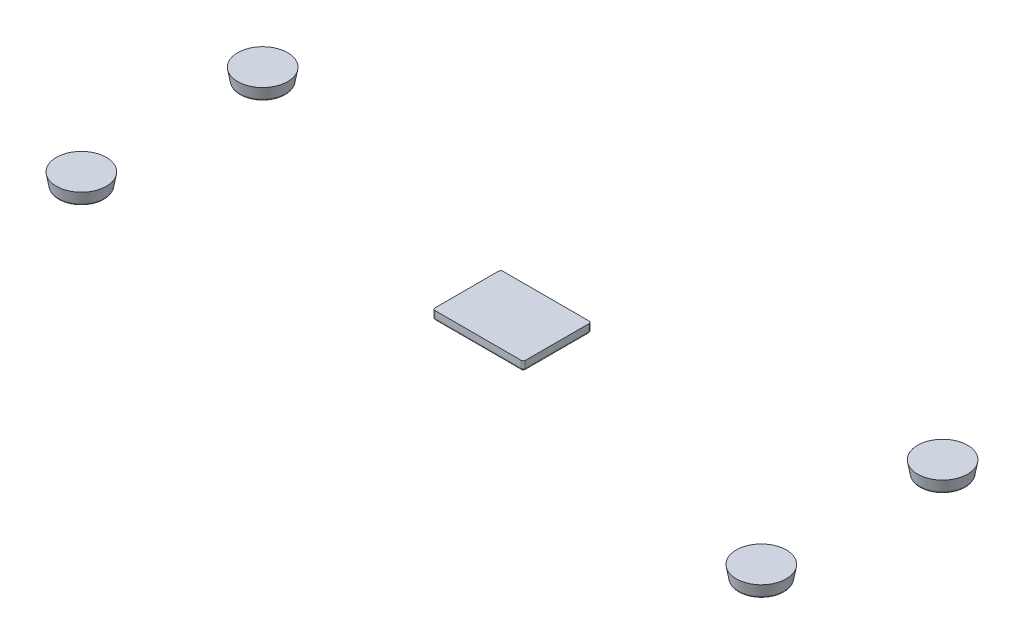
ISO-10303-21;
HEADER;
FILE_DESCRIPTION(('STEP AP214'),'2;1');
FILE_NAME('part.step','',(''),(''),'','','');
FILE_SCHEMA(('AUTOMOTIVE_DESIGN { 1 0 10303 214 1 1 1 1 }'));
ENDSEC;
DATA;
#1=APPLICATION_CONTEXT('core data for automotive mechanical design processes');
#2=APPLICATION_PROTOCOL_DEFINITION('international standard','automotive_design',2000,#1);
#3=PRODUCT_CONTEXT('',#1,'mechanical');
#4=PRODUCT('Part','Part','',(#3));
#5=PRODUCT_RELATED_PRODUCT_CATEGORY('part','',(#4));
#6=PRODUCT_DEFINITION_FORMATION('','',#4);
#7=PRODUCT_DEFINITION_CONTEXT('part definition',#1,'design');
#8=PRODUCT_DEFINITION('design','',#6,#7);
#9=PRODUCT_DEFINITION_SHAPE('','',#8);
#10=(LENGTH_UNIT() NAMED_UNIT(*) SI_UNIT(.MILLI.,.METRE.));
#11=(NAMED_UNIT(*) PLANE_ANGLE_UNIT() SI_UNIT($,.RADIAN.));
#12=(NAMED_UNIT(*) SI_UNIT($,.STERADIAN.) SOLID_ANGLE_UNIT());
#13=UNCERTAINTY_MEASURE_WITH_UNIT(LENGTH_MEASURE(1.E-05),#10,'distance_accuracy_value','');
#14=(GEOMETRIC_REPRESENTATION_CONTEXT(3) GLOBAL_UNCERTAINTY_ASSIGNED_CONTEXT((#13)) GLOBAL_UNIT_ASSIGNED_CONTEXT((#10,
#11,#12)) REPRESENTATION_CONTEXT('',''));
#15=CARTESIAN_POINT('',(0.,0.,0.));
#16=DIRECTION('',(0.,0.,1.));
#17=DIRECTION('',(1.,0.,0.));
#18=AXIS2_PLACEMENT_3D('',#15,#16,#17);
#19=CARTESIAN_POINT('',(10.,0.95,-7.5));
#20=DIRECTION('',(1.,0.,0.));
#21=DIRECTION('',(0.,0.,-1.));
#22=AXIS2_PLACEMENT_3D('',#19,#20,#21);
#23=PLANE('',#22);
#24=DIRECTION('',(0.,1.,0.));
#25=VECTOR('',#24,1.);
#26=CARTESIAN_POINT('',(10.,0.95,7.));
#27=LINE('',#26,#25);
#28=CARTESIAN_POINT('',(10.,2.95,7.));
#29=VERTEX_POINT('',#28);
#30=CARTESIAN_POINT('',(10.,1.45,7.));
#31=VERTEX_POINT('',#30);
#32=EDGE_CURVE('E172',#29,#31,#27,.F.);
#33=ORIENTED_EDGE('',*,*,#32,.T.);
#34=DIRECTION('',(0.,0.,-1.));
#35=VECTOR('',#34,1.);
#36=CARTESIAN_POINT('',(10.,1.45,-7.));
#37=LINE('',#36,#35);
#38=CARTESIAN_POINT('',(10.,1.45,-7.));
#39=VERTEX_POINT('',#38);
#40=EDGE_CURVE('E193',#31,#39,#37,.T.);
#41=ORIENTED_EDGE('',*,*,#40,.T.);
#42=DIRECTION('',(0.,1.,0.));
#43=VECTOR('',#42,1.);
#44=CARTESIAN_POINT('',(10.,0.95,-7.));
#45=LINE('',#44,#43);
#46=CARTESIAN_POINT('',(10.,2.95,-7.));
#47=VERTEX_POINT('',#46);
#48=EDGE_CURVE('E170',#39,#47,#45,.T.);
#49=ORIENTED_EDGE('',*,*,#48,.T.);
#50=DIRECTION('',(0.,0.,-1.));
#51=VECTOR('',#50,1.);
#52=CARTESIAN_POINT('',(10.,2.95,-7.5));
#53=LINE('',#52,#51);
#54=EDGE_CURVE('E130',#29,#47,#53,.T.);
#55=ORIENTED_EDGE('',*,*,#54,.F.);
#56=EDGE_LOOP('',(#33,#41,#49,#55));
#57=FACE_BOUND('',#56,.T.);
#58=ADVANCED_FACE('F46',(#57),#23,.T.);
#59=CARTESIAN_POINT('',(-9.99999999999999,0.95,7.5));
#60=DIRECTION('',(0.,0.,1.));
#61=DIRECTION('',(1.,0.,0.));
#62=AXIS2_PLACEMENT_3D('',#59,#60,#61);
#63=PLANE('',#62);
#64=DIRECTION('',(0.,1.,0.));
#65=VECTOR('',#64,1.);
#66=CARTESIAN_POINT('',(-9.49999999999999,0.95,7.5));
#67=LINE('',#66,#65);
#68=CARTESIAN_POINT('',(-9.49999999999999,2.95,7.5));
#69=VERTEX_POINT('',#68);
#70=CARTESIAN_POINT('',(-9.49999999999999,1.45,7.5));
#71=VERTEX_POINT('',#70);
#72=EDGE_CURVE('E168',#69,#71,#67,.F.);
#73=ORIENTED_EDGE('',*,*,#72,.T.);
#74=DIRECTION('',(1.,0.,0.));
#75=VECTOR('',#74,1.);
#76=CARTESIAN_POINT('',(9.5,1.45,7.5));
#77=LINE('',#76,#75);
#78=CARTESIAN_POINT('',(9.5,1.45,7.5));
#79=VERTEX_POINT('',#78);
#80=EDGE_CURVE('E12',#71,#79,#77,.T.);
#81=ORIENTED_EDGE('',*,*,#80,.T.);
#82=DIRECTION('',(0.,1.,0.));
#83=VECTOR('',#82,1.);
#84=CARTESIAN_POINT('',(9.5,0.95,7.5));
#85=LINE('',#84,#83);
#86=CARTESIAN_POINT('',(9.5,2.95,7.5));
#87=VERTEX_POINT('',#86);
#88=EDGE_CURVE('E166',#79,#87,#85,.T.);
#89=ORIENTED_EDGE('',*,*,#88,.T.);
#90=DIRECTION('',(1.,0.,0.));
#91=VECTOR('',#90,1.);
#92=CARTESIAN_POINT('',(-9.99999999999999,2.95,7.5));
#93=LINE('',#92,#91);
#94=EDGE_CURVE('E149',#69,#87,#93,.T.);
#95=ORIENTED_EDGE('',*,*,#94,.F.);
#96=EDGE_LOOP('',(#73,#81,#89,#95));
#97=FACE_BOUND('',#96,.T.);
#98=ADVANCED_FACE('F271',(#97),#63,.T.);
#99=CARTESIAN_POINT('',(-10.,0.95,-7.5));
#100=DIRECTION('',(-1.,0.,0.));
#101=DIRECTION('',(0.,0.,1.));
#102=AXIS2_PLACEMENT_3D('',#99,#100,#101);
#103=PLANE('',#102);
#104=DIRECTION('',(0.,1.,0.));
#105=VECTOR('',#104,1.);
#106=CARTESIAN_POINT('',(-10.,0.95,-7.));
#107=LINE('',#106,#105);
#108=CARTESIAN_POINT('',(-10.,2.95,-7.));
#109=VERTEX_POINT('',#108);
#110=CARTESIAN_POINT('',(-10.,1.45,-7.));
#111=VERTEX_POINT('',#110);
#112=EDGE_CURVE('E163',#109,#111,#107,.F.);
#113=ORIENTED_EDGE('',*,*,#112,.T.);
#114=DIRECTION('',(0.,0.,1.));
#115=VECTOR('',#114,1.);
#116=CARTESIAN_POINT('',(-9.99999999999999,1.45,7.));
#117=LINE('',#116,#115);
#118=CARTESIAN_POINT('',(-9.99999999999999,1.45,7.));
#119=VERTEX_POINT('',#118);
#120=EDGE_CURVE('E177',#111,#119,#117,.T.);
#121=ORIENTED_EDGE('',*,*,#120,.T.);
#122=DIRECTION('',(0.,1.,0.));
#123=VECTOR('',#122,1.);
#124=CARTESIAN_POINT('',(-9.99999999999999,0.95,7.));
#125=LINE('',#124,#123);
#126=CARTESIAN_POINT('',(-9.99999999999999,2.95,7.));
#127=VERTEX_POINT('',#126);
#128=EDGE_CURVE('E161',#119,#127,#125,.T.);
#129=ORIENTED_EDGE('',*,*,#128,.T.);
#130=DIRECTION('',(0.,0.,1.));
#131=VECTOR('',#130,1.);
#132=CARTESIAN_POINT('',(-10.,2.95,-7.5));
#133=LINE('',#132,#131);
#134=EDGE_CURVE('E144',#109,#127,#133,.T.);
#135=ORIENTED_EDGE('',*,*,#134,.F.);
#136=EDGE_LOOP('',(#113,#121,#129,#135));
#137=FACE_BOUND('',#136,.T.);
#138=ADVANCED_FACE('F228',(#137),#103,.T.);
#139=CARTESIAN_POINT('',(-10.,0.95,-7.5));
#140=DIRECTION('',(0.,0.,-1.));
#141=DIRECTION('',(-1.,0.,0.));
#142=AXIS2_PLACEMENT_3D('',#139,#140,#141);
#143=PLANE('',#142);
#144=DIRECTION('',(0.,1.,0.));
#145=VECTOR('',#144,1.);
#146=CARTESIAN_POINT('',(9.5,0.95,-7.5));
#147=LINE('',#146,#145);
#148=CARTESIAN_POINT('',(9.5,2.95,-7.5));
#149=VERTEX_POINT('',#148);
#150=CARTESIAN_POINT('',(9.5,1.45,-7.5));
#151=VERTEX_POINT('',#150);
#152=EDGE_CURVE('E140',#149,#151,#147,.F.);
#153=ORIENTED_EDGE('',*,*,#152,.T.);
#154=DIRECTION('',(-1.,0.,0.));
#155=VECTOR('',#154,1.);
#156=CARTESIAN_POINT('',(-9.5,1.45,-7.5));
#157=LINE('',#156,#155);
#158=CARTESIAN_POINT('',(-9.5,1.45,-7.5));
#159=VERTEX_POINT('',#158);
#160=EDGE_CURVE('E190',#151,#159,#157,.T.);
#161=ORIENTED_EDGE('',*,*,#160,.T.);
#162=DIRECTION('',(0.,1.,0.));
#163=VECTOR('',#162,1.);
#164=CARTESIAN_POINT('',(-9.5,0.95,-7.5));
#165=LINE('',#164,#163);
#166=CARTESIAN_POINT('',(-9.5,2.95,-7.5));
#167=VERTEX_POINT('',#166);
#168=EDGE_CURVE('E135',#159,#167,#165,.T.);
#169=ORIENTED_EDGE('',*,*,#168,.T.);
#170=DIRECTION('',(-1.,0.,0.));
#171=VECTOR('',#170,1.);
#172=CARTESIAN_POINT('',(-10.,2.95,-7.5));
#173=LINE('',#172,#171);
#174=EDGE_CURVE('E128',#149,#167,#173,.T.);
#175=ORIENTED_EDGE('',*,*,#174,.F.);
#176=EDGE_LOOP('',(#153,#161,#169,#175));
#177=FACE_BOUND('',#176,.T.);
#178=ADVANCED_FACE('F139',(#177),#143,.T.);
#179=CARTESIAN_POINT('',(0.,0.95,0.));
#180=DIRECTION('',(0.,1.,0.));
#181=DIRECTION('',(0.,0.,1.));
#182=AXIS2_PLACEMENT_3D('',#179,#180,#181);
#183=PLANE('',#182);
#184=DIRECTION('',(1.,0.,0.));
#185=VECTOR('',#184,1.);
#186=CARTESIAN_POINT('',(-9.49999999999999,0.95,7.));
#187=LINE('',#186,#185);
#188=CARTESIAN_POINT('',(9.5,0.95,7.));
#189=VERTEX_POINT('',#188);
#190=CARTESIAN_POINT('',(-9.49999999999999,0.95,7.));
#191=VERTEX_POINT('',#190);
#192=EDGE_CURVE('E179',#189,#191,#187,.F.);
#193=ORIENTED_EDGE('',*,*,#192,.T.);
#194=DIRECTION('',(0.,0.,1.));
#195=VECTOR('',#194,1.);
#196=CARTESIAN_POINT('',(-9.5,0.95,-7.));
#197=LINE('',#196,#195);
#198=CARTESIAN_POINT('',(-9.5,0.95,-7.));
#199=VERTEX_POINT('',#198);
#200=EDGE_CURVE('E185',#191,#199,#197,.F.);
#201=ORIENTED_EDGE('',*,*,#200,.T.);
#202=DIRECTION('',(-1.,0.,0.));
#203=VECTOR('',#202,1.);
#204=CARTESIAN_POINT('',(9.5,0.95,-7.));
#205=LINE('',#204,#203);
#206=CARTESIAN_POINT('',(9.5,0.95,-7.));
#207=VERTEX_POINT('',#206);
#208=EDGE_CURVE('E183',#199,#207,#205,.F.);
#209=ORIENTED_EDGE('',*,*,#208,.T.);
#210=DIRECTION('',(0.,0.,-1.));
#211=VECTOR('',#210,1.);
#212=CARTESIAN_POINT('',(9.5,0.95,7.));
#213=LINE('',#212,#211);
#214=EDGE_CURVE('E181',#207,#189,#213,.F.);
#215=ORIENTED_EDGE('',*,*,#214,.T.);
#216=EDGE_LOOP('',(#193,#201,#209,#215));
#217=FACE_BOUND('',#216,.T.);
#218=ADVANCED_FACE('F261',(#217),#183,.F.);
#219=CARTESIAN_POINT('',(0.,2.95,0.));
#220=DIRECTION('',(0.,1.,0.));
#221=DIRECTION('',(0.,0.,1.));
#222=AXIS2_PLACEMENT_3D('',#219,#220,#221);
#223=PLANE('',#222);
#224=ORIENTED_EDGE('',*,*,#174,.T.);
#225=CARTESIAN_POINT('',(-9.5,2.95,-7.));
#226=DIRECTION('',(0.,1.,0.));
#227=DIRECTION('',(0.,0.,1.));
#228=AXIS2_PLACEMENT_3D('',#225,#226,#227);
#229=CIRCLE('',#228,0.5);
#230=EDGE_CURVE('E159',#167,#109,#229,.T.);
#231=ORIENTED_EDGE('',*,*,#230,.T.);
#232=ORIENTED_EDGE('',*,*,#134,.T.);
#233=CARTESIAN_POINT('',(-9.49999999999999,2.95,7.));
#234=DIRECTION('',(0.,1.,0.));
#235=DIRECTION('',(0.,0.,1.));
#236=AXIS2_PLACEMENT_3D('',#233,#234,#235);
#237=CIRCLE('',#236,0.5);
#238=EDGE_CURVE('E157',#127,#69,#237,.T.);
#239=ORIENTED_EDGE('',*,*,#238,.T.);
#240=ORIENTED_EDGE('',*,*,#94,.T.);
#241=CARTESIAN_POINT('',(9.5,2.95,7.));
#242=DIRECTION('',(0.,1.,0.));
#243=DIRECTION('',(0.,0.,1.));
#244=AXIS2_PLACEMENT_3D('',#241,#242,#243);
#245=CIRCLE('',#244,0.5);
#246=EDGE_CURVE('E134',#87,#29,#245,.T.);
#247=ORIENTED_EDGE('',*,*,#246,.T.);
#248=ORIENTED_EDGE('',*,*,#54,.T.);
#249=CARTESIAN_POINT('',(9.5,2.95,-7.));
#250=DIRECTION('',(0.,1.,0.));
#251=DIRECTION('',(0.,0.,1.));
#252=AXIS2_PLACEMENT_3D('',#249,#250,#251);
#253=CIRCLE('',#252,0.5);
#254=EDGE_CURVE('E125',#47,#149,#253,.T.);
#255=ORIENTED_EDGE('',*,*,#254,.T.);
#256=EDGE_LOOP('',(#224,#231,#232,#239,#240,#247,#248,#255));
#257=FACE_BOUND('',#256,.T.);
#258=ADVANCED_FACE('F127',(#257),#223,.T.);
#259=CARTESIAN_POINT('',(-9.5,0.95,-7.));
#260=DIRECTION('',(0.,1.,0.));
#261=DIRECTION('',(0.,0.,1.));
#262=AXIS2_PLACEMENT_3D('',#259,#260,#261);
#263=CYLINDRICAL_SURFACE('',#262,0.5);
#264=ORIENTED_EDGE('',*,*,#168,.F.);
#265=CARTESIAN_POINT('',(-9.5,1.45,-7.));
#266=DIRECTION('',(0.,1.,0.));
#267=DIRECTION('',(0.,0.,1.));
#268=AXIS2_PLACEMENT_3D('',#265,#266,#267);
#269=CIRCLE('',#268,0.5);
#270=EDGE_CURVE('E188',#159,#111,#269,.T.);
#271=ORIENTED_EDGE('',*,*,#270,.T.);
#272=ORIENTED_EDGE('',*,*,#112,.F.);
#273=ORIENTED_EDGE('',*,*,#230,.F.);
#274=EDGE_LOOP('',(#264,#271,#272,#273));
#275=FACE_BOUND('',#274,.T.);
#276=ADVANCED_FACE('F232',(#275),#263,.T.);
#277=CARTESIAN_POINT('',(-9.49999999999999,0.95,7.));
#278=DIRECTION('',(0.,1.,0.));
#279=DIRECTION('',(0.,0.,1.));
#280=AXIS2_PLACEMENT_3D('',#277,#278,#279);
#281=CYLINDRICAL_SURFACE('',#280,0.5);
#282=ORIENTED_EDGE('',*,*,#128,.F.);
#283=CARTESIAN_POINT('',(-9.49999999999999,1.45,7.));
#284=DIRECTION('',(0.,1.,0.));
#285=DIRECTION('',(0.,0.,1.));
#286=AXIS2_PLACEMENT_3D('',#283,#284,#285);
#287=CIRCLE('',#286,0.5);
#288=EDGE_CURVE('E174',#119,#71,#287,.T.);
#289=ORIENTED_EDGE('',*,*,#288,.T.);
#290=ORIENTED_EDGE('',*,*,#72,.F.);
#291=ORIENTED_EDGE('',*,*,#238,.F.);
#292=EDGE_LOOP('',(#282,#289,#290,#291));
#293=FACE_BOUND('',#292,.T.);
#294=ADVANCED_FACE('F244',(#293),#281,.T.);
#295=CARTESIAN_POINT('',(9.5,0.95,7.));
#296=DIRECTION('',(0.,1.,0.));
#297=DIRECTION('',(0.,0.,1.));
#298=AXIS2_PLACEMENT_3D('',#295,#296,#297);
#299=CYLINDRICAL_SURFACE('',#298,0.5);
#300=ORIENTED_EDGE('',*,*,#88,.F.);
#301=CARTESIAN_POINT('',(9.5,1.45,7.));
#302=DIRECTION('',(0.,1.,0.));
#303=DIRECTION('',(0.,0.,1.));
#304=AXIS2_PLACEMENT_3D('',#301,#302,#303);
#305=CIRCLE('',#304,0.5);
#306=EDGE_CURVE('E55',#79,#31,#305,.T.);
#307=ORIENTED_EDGE('',*,*,#306,.T.);
#308=ORIENTED_EDGE('',*,*,#32,.F.);
#309=ORIENTED_EDGE('',*,*,#246,.F.);
#310=EDGE_LOOP('',(#300,#307,#308,#309));
#311=FACE_BOUND('',#310,.T.);
#312=ADVANCED_FACE('F283',(#311),#299,.T.);
#313=CARTESIAN_POINT('',(9.5,0.95,-7.));
#314=DIRECTION('',(0.,1.,0.));
#315=DIRECTION('',(0.,0.,1.));
#316=AXIS2_PLACEMENT_3D('',#313,#314,#315);
#317=CYLINDRICAL_SURFACE('',#316,0.5);
#318=ORIENTED_EDGE('',*,*,#48,.F.);
#319=CARTESIAN_POINT('',(9.5,1.45,-7.));
#320=DIRECTION('',(0.,1.,0.));
#321=DIRECTION('',(0.,0.,1.));
#322=AXIS2_PLACEMENT_3D('',#319,#320,#321);
#323=CIRCLE('',#322,0.5);
#324=EDGE_CURVE('E148',#39,#151,#323,.T.);
#325=ORIENTED_EDGE('',*,*,#324,.T.);
#326=ORIENTED_EDGE('',*,*,#152,.F.);
#327=ORIENTED_EDGE('',*,*,#254,.F.);
#328=EDGE_LOOP('',(#318,#325,#326,#327));
#329=FACE_BOUND('',#328,.T.);
#330=ADVANCED_FACE('F146',(#329),#317,.T.);
#331=CARTESIAN_POINT('',(9.5,1.45,-7.));
#332=DIRECTION('',(0.,1.,0.));
#333=DIRECTION('',(0.,0.,1.));
#334=AXIS2_PLACEMENT_3D('',#331,#332,#333);
#335=SPHERICAL_SURFACE('',#334,0.5);
#336=CARTESIAN_POINT('',(9.5,1.45,-7.));
#337=DIRECTION('',(-1.,0.,0.));
#338=DIRECTION('',(0.,0.,1.));
#339=AXIS2_PLACEMENT_3D('',#336,#337,#338);
#340=CIRCLE('',#339,0.5);
#341=EDGE_CURVE('E211',#151,#207,#340,.T.);
#342=ORIENTED_EDGE('',*,*,#341,.F.);
#343=ORIENTED_EDGE('',*,*,#324,.F.);
#344=CARTESIAN_POINT('',(9.5,1.45,-7.));
#345=DIRECTION('',(0.,0.,1.));
#346=DIRECTION('',(1.,0.,0.));
#347=AXIS2_PLACEMENT_3D('',#344,#345,#346);
#348=CIRCLE('',#347,0.5);
#349=EDGE_CURVE('E50',#207,#39,#348,.T.);
#350=ORIENTED_EDGE('',*,*,#349,.F.);
#351=EDGE_LOOP('',(#342,#343,#350));
#352=FACE_BOUND('',#351,.T.);
#353=ADVANCED_FACE('F48',(#352),#335,.T.);
#354=CARTESIAN_POINT('',(9.5,1.45,-7.5));
#355=DIRECTION('',(0.,0.,1.));
#356=DIRECTION('',(1.,0.,0.));
#357=AXIS2_PLACEMENT_3D('',#354,#355,#356);
#358=CYLINDRICAL_SURFACE('',#357,0.5);
#359=ORIENTED_EDGE('',*,*,#349,.T.);
#360=ORIENTED_EDGE('',*,*,#40,.F.);
#361=CARTESIAN_POINT('',(9.5,1.45,7.));
#362=DIRECTION('',(0.,0.,1.));
#363=DIRECTION('',(1.,0.,0.));
#364=AXIS2_PLACEMENT_3D('',#361,#362,#363);
#365=CIRCLE('',#364,0.5);
#366=EDGE_CURVE('E209',#189,#31,#365,.T.);
#367=ORIENTED_EDGE('',*,*,#366,.F.);
#368=ORIENTED_EDGE('',*,*,#214,.F.);
#369=EDGE_LOOP('',(#359,#360,#367,#368));
#370=FACE_BOUND('',#369,.T.);
#371=ADVANCED_FACE('F256',(#370),#358,.T.);
#372=CARTESIAN_POINT('',(-10.,1.45,-7.));
#373=DIRECTION('',(1.,0.,0.));
#374=DIRECTION('',(0.,0.,-1.));
#375=AXIS2_PLACEMENT_3D('',#372,#373,#374);
#376=CYLINDRICAL_SURFACE('',#375,0.5);
#377=ORIENTED_EDGE('',*,*,#341,.T.);
#378=ORIENTED_EDGE('',*,*,#208,.F.);
#379=CARTESIAN_POINT('',(-9.5,1.45,-7.));
#380=DIRECTION('',(-1.,0.,0.));
#381=DIRECTION('',(0.,0.,1.));
#382=AXIS2_PLACEMENT_3D('',#379,#380,#381);
#383=CIRCLE('',#382,0.5);
#384=EDGE_CURVE('E206',#159,#199,#383,.T.);
#385=ORIENTED_EDGE('',*,*,#384,.F.);
#386=ORIENTED_EDGE('',*,*,#160,.F.);
#387=EDGE_LOOP('',(#377,#378,#385,#386));
#388=FACE_BOUND('',#387,.T.);
#389=ADVANCED_FACE('F259',(#388),#376,.T.);
#390=CARTESIAN_POINT('',(9.5,1.45,7.));
#391=DIRECTION('',(0.,1.,0.));
#392=DIRECTION('',(0.,0.,1.));
#393=AXIS2_PLACEMENT_3D('',#390,#391,#392);
#394=SPHERICAL_SURFACE('',#393,0.5);
#395=ORIENTED_EDGE('',*,*,#366,.T.);
#396=ORIENTED_EDGE('',*,*,#306,.F.);
#397=CARTESIAN_POINT('',(9.5,1.45,7.));
#398=DIRECTION('',(-1.,0.,0.));
#399=DIRECTION('',(0.,0.,1.));
#400=AXIS2_PLACEMENT_3D('',#397,#398,#399);
#401=CIRCLE('',#400,0.5);
#402=EDGE_CURVE('E203',#189,#79,#401,.T.);
#403=ORIENTED_EDGE('',*,*,#402,.F.);
#404=EDGE_LOOP('',(#395,#396,#403));
#405=FACE_BOUND('',#404,.T.);
#406=ADVANCED_FACE('F254',(#405),#394,.T.);
#407=CARTESIAN_POINT('',(-9.5,1.45,-7.));
#408=DIRECTION('',(0.,1.,0.));
#409=DIRECTION('',(0.,0.,1.));
#410=AXIS2_PLACEMENT_3D('',#407,#408,#409);
#411=SPHERICAL_SURFACE('',#410,0.5);
#412=ORIENTED_EDGE('',*,*,#270,.F.);
#413=ORIENTED_EDGE('',*,*,#384,.T.);
#414=CARTESIAN_POINT('',(-9.5,1.45,-7.));
#415=DIRECTION('',(0.,0.,1.));
#416=DIRECTION('',(1.,0.,0.));
#417=AXIS2_PLACEMENT_3D('',#414,#415,#416);
#418=CIRCLE('',#417,0.5);
#419=EDGE_CURVE('E201',#111,#199,#418,.T.);
#420=ORIENTED_EDGE('',*,*,#419,.F.);
#421=EDGE_LOOP('',(#412,#413,#420));
#422=FACE_BOUND('',#421,.T.);
#423=ADVANCED_FACE('F236',(#422),#411,.T.);
#424=CARTESIAN_POINT('',(-9.99999999999999,1.45,7.));
#425=DIRECTION('',(-1.,0.,0.));
#426=DIRECTION('',(0.,0.,1.));
#427=AXIS2_PLACEMENT_3D('',#424,#425,#426);
#428=CYLINDRICAL_SURFACE('',#427,0.5);
#429=ORIENTED_EDGE('',*,*,#402,.T.);
#430=ORIENTED_EDGE('',*,*,#80,.F.);
#431=CARTESIAN_POINT('',(-9.49999999999999,1.45,7.));
#432=DIRECTION('',(-1.,0.,0.));
#433=DIRECTION('',(0.,0.,1.));
#434=AXIS2_PLACEMENT_3D('',#431,#432,#433);
#435=CIRCLE('',#434,0.5);
#436=EDGE_CURVE('E199',#191,#71,#435,.T.);
#437=ORIENTED_EDGE('',*,*,#436,.F.);
#438=ORIENTED_EDGE('',*,*,#192,.F.);
#439=EDGE_LOOP('',(#429,#430,#437,#438));
#440=FACE_BOUND('',#439,.T.);
#441=ADVANCED_FACE('F251',(#440),#428,.T.);
#442=CARTESIAN_POINT('',(-9.5,1.45,-7.5));
#443=DIRECTION('',(0.,0.,-1.));
#444=DIRECTION('',(-1.,0.,0.));
#445=AXIS2_PLACEMENT_3D('',#442,#443,#444);
#446=CYLINDRICAL_SURFACE('',#445,0.5);
#447=ORIENTED_EDGE('',*,*,#419,.T.);
#448=ORIENTED_EDGE('',*,*,#200,.F.);
#449=CARTESIAN_POINT('',(-9.49999999999999,1.45,7.));
#450=DIRECTION('',(0.,0.,1.));
#451=DIRECTION('',(1.,0.,0.));
#452=AXIS2_PLACEMENT_3D('',#449,#450,#451);
#453=CIRCLE('',#452,0.5);
#454=EDGE_CURVE('E196',#119,#191,#453,.T.);
#455=ORIENTED_EDGE('',*,*,#454,.F.);
#456=ORIENTED_EDGE('',*,*,#120,.F.);
#457=EDGE_LOOP('',(#447,#448,#455,#456));
#458=FACE_BOUND('',#457,.T.);
#459=ADVANCED_FACE('F241',(#458),#446,.T.);
#460=CARTESIAN_POINT('',(-9.49999999999999,1.45,7.));
#461=DIRECTION('',(0.,1.,0.));
#462=DIRECTION('',(0.,0.,1.));
#463=AXIS2_PLACEMENT_3D('',#460,#461,#462);
#464=SPHERICAL_SURFACE('',#463,0.5);
#465=ORIENTED_EDGE('',*,*,#436,.T.);
#466=ORIENTED_EDGE('',*,*,#288,.F.);
#467=ORIENTED_EDGE('',*,*,#454,.T.);
#468=EDGE_LOOP('',(#465,#466,#467));
#469=FACE_BOUND('',#468,.T.);
#470=ADVANCED_FACE('F247',(#469),#464,.T.);
#471=CLOSED_SHELL('',(#58,#98,#138,#178,#218,#258,#276,#294,#312,#330,#353,#371,#389,#406,#423,
#441,#459,#470));
#472=MANIFOLD_SOLID_BREP('B2',#471);
#473=CARTESIAN_POINT('',(75.,0.,20.));
#474=DIRECTION('',(0.,1.,0.));
#475=DIRECTION('',(0.,0.,1.));
#476=AXIS2_PLACEMENT_3D('',#473,#474,#475);
#477=CONICAL_SURFACE('',#476,5.,0.174532925199433);
#478=CARTESIAN_POINT('',(75.,0.413175911166536,20.));
#479=DIRECTION('',(0.,-1.,0.));
#480=DIRECTION('',(0.,0.,-1.));
#481=AXIS2_PLACEMENT_3D('',#478,#479,#480);
#482=CIRCLE('',#481,5.07285406091747);
#483=CARTESIAN_POINT('',(75.,0.413175911166536,14.9271459390825));
#484=VERTEX_POINT('',#483);
#485=EDGE_CURVE('E433',#484,#484,#482,.F.);
#486=ORIENTED_EDGE('',*,*,#485,.T.);
#487=EDGE_LOOP('',(#486));
#488=FACE_BOUND('',#487,.T.);
#489=CARTESIAN_POINT('',(75.,2.95,20.));
#490=DIRECTION('',(0.,1.,0.));
#491=DIRECTION('',(0.,0.,1.));
#492=AXIS2_PLACEMENT_3D('',#489,#490,#491);
#493=CIRCLE('',#492,5.52016459308998);
#494=CARTESIAN_POINT('',(75.,2.95,25.52016459309));
#495=VERTEX_POINT('',#494);
#496=EDGE_CURVE('E437',#495,#495,#493,.T.);
#497=ORIENTED_EDGE('',*,*,#496,.F.);
#498=EDGE_LOOP('',(#497));
#499=FACE_BOUND('',#498,.T.);
#500=ADVANCED_FACE('F426',(#488,#499),#477,.T.);
#501=CARTESIAN_POINT('',(75.,2.95,20.));
#502=DIRECTION('',(0.,1.,0.));
#503=DIRECTION('',(0.,0.,1.));
#504=AXIS2_PLACEMENT_3D('',#501,#502,#503);
#505=PLANE('',#504);
#506=ORIENTED_EDGE('',*,*,#496,.T.);
#507=EDGE_LOOP('',(#506));
#508=FACE_BOUND('',#507,.T.);
#509=ADVANCED_FACE('F444',(#508),#505,.T.);
#510=CARTESIAN_POINT('',(75.,0.,20.));
#511=DIRECTION('',(0.,1.,0.));
#512=DIRECTION('',(0.,0.,1.));
#513=AXIS2_PLACEMENT_3D('',#510,#511,#512);
#514=PLANE('',#513);
#515=CARTESIAN_POINT('',(75.,0.,20.));
#516=DIRECTION('',(0.,1.,0.));
#517=DIRECTION('',(0.,0.,1.));
#518=AXIS2_PLACEMENT_3D('',#515,#516,#517);
#519=CIRCLE('',#518,4.58045018441136);
#520=CARTESIAN_POINT('',(75.,0.,24.5804501844114));
#521=VERTEX_POINT('',#520);
#522=EDGE_CURVE('E45',#521,#521,#519,.F.);
#523=ORIENTED_EDGE('',*,*,#522,.T.);
#524=EDGE_LOOP('',(#523));
#525=FACE_BOUND('',#524,.T.);
#526=ADVANCED_FACE('F450',(#525),#514,.F.);
#527=CARTESIAN_POINT('',(75.,0.5,20.));
#528=DIRECTION('',(0.,1.,0.));
#529=DIRECTION('',(0.,0.,1.));
#530=AXIS2_PLACEMENT_3D('',#527,#528,#529);
#531=TOROIDAL_SURFACE('',#530,4.58045018441136,0.5);
#532=ORIENTED_EDGE('',*,*,#522,.F.);
#533=EDGE_LOOP('',(#532));
#534=FACE_BOUND('',#533,.T.);
#535=ORIENTED_EDGE('',*,*,#485,.F.);
#536=EDGE_LOOP('',(#535));
#537=FACE_BOUND('',#536,.T.);
#538=ADVANCED_FACE('F428',(#534,#537),#531,.T.);
#539=CLOSED_SHELL('',(#500,#509,#526,#538));
#540=MANIFOLD_SOLID_BREP('B6',#539);
#541=CARTESIAN_POINT('',(75.,0.,-20.));
#542=DIRECTION('',(0.,1.,0.));
#543=DIRECTION('',(0.,0.,1.));
#544=AXIS2_PLACEMENT_3D('',#541,#542,#543);
#545=CONICAL_SURFACE('',#544,5.,0.174532925199433);
#546=CARTESIAN_POINT('',(75.,0.413175911166536,-20.));
#547=DIRECTION('',(0.,-1.,0.));
#548=DIRECTION('',(0.,0.,-1.));
#549=AXIS2_PLACEMENT_3D('',#546,#547,#548);
#550=CIRCLE('',#549,5.07285406091747);
#551=CARTESIAN_POINT('',(75.,0.413175911166536,-25.0728540609175));
#552=VERTEX_POINT('',#551);
#553=EDGE_CURVE('E497',#552,#552,#550,.F.);
#554=ORIENTED_EDGE('',*,*,#553,.T.);
#555=EDGE_LOOP('',(#554));
#556=FACE_BOUND('',#555,.T.);
#557=CARTESIAN_POINT('',(75.,2.95,-20.));
#558=DIRECTION('',(0.,1.,0.));
#559=DIRECTION('',(0.,0.,1.));
#560=AXIS2_PLACEMENT_3D('',#557,#558,#559);
#561=CIRCLE('',#560,5.52016459308998);
#562=CARTESIAN_POINT('',(75.,2.95,-14.47983540691));
#563=VERTEX_POINT('',#562);
#564=EDGE_CURVE('E501',#563,#563,#561,.T.);
#565=ORIENTED_EDGE('',*,*,#564,.F.);
#566=EDGE_LOOP('',(#565));
#567=FACE_BOUND('',#566,.T.);
#568=ADVANCED_FACE('F490',(#556,#567),#545,.T.);
#569=CARTESIAN_POINT('',(75.,2.95,-20.));
#570=DIRECTION('',(0.,1.,0.));
#571=DIRECTION('',(0.,0.,1.));
#572=AXIS2_PLACEMENT_3D('',#569,#570,#571);
#573=PLANE('',#572);
#574=ORIENTED_EDGE('',*,*,#564,.T.);
#575=EDGE_LOOP('',(#574));
#576=FACE_BOUND('',#575,.T.);
#577=ADVANCED_FACE('F508',(#576),#573,.T.);
#578=CARTESIAN_POINT('',(75.,0.,-20.));
#579=DIRECTION('',(0.,1.,0.));
#580=DIRECTION('',(0.,0.,1.));
#581=AXIS2_PLACEMENT_3D('',#578,#579,#580);
#582=PLANE('',#581);
#583=CARTESIAN_POINT('',(75.,0.,-20.));
#584=DIRECTION('',(0.,1.,0.));
#585=DIRECTION('',(0.,0.,1.));
#586=AXIS2_PLACEMENT_3D('',#583,#584,#585);
#587=CIRCLE('',#586,4.58045018441136);
#588=CARTESIAN_POINT('',(75.,0.,-15.4195498155886));
#589=VERTEX_POINT('',#588);
#590=EDGE_CURVE('E425',#589,#589,#587,.F.);
#591=ORIENTED_EDGE('',*,*,#590,.T.);
#592=EDGE_LOOP('',(#591));
#593=FACE_BOUND('',#592,.T.);
#594=ADVANCED_FACE('F514',(#593),#582,.F.);
#595=CARTESIAN_POINT('',(75.,0.5,-20.));
#596=DIRECTION('',(0.,1.,0.));
#597=DIRECTION('',(0.,0.,1.));
#598=AXIS2_PLACEMENT_3D('',#595,#596,#597);
#599=TOROIDAL_SURFACE('',#598,4.58045018441136,0.5);
#600=ORIENTED_EDGE('',*,*,#590,.F.);
#601=EDGE_LOOP('',(#600));
#602=FACE_BOUND('',#601,.T.);
#603=ORIENTED_EDGE('',*,*,#553,.F.);
#604=EDGE_LOOP('',(#603));
#605=FACE_BOUND('',#604,.T.);
#606=ADVANCED_FACE('F492',(#602,#605),#599,.T.);
#607=CLOSED_SHELL('',(#568,#577,#594,#606));
#608=MANIFOLD_SOLID_BREP('B40',#607);
#609=CARTESIAN_POINT('',(-75.,0.,20.));
#610=DIRECTION('',(0.,1.,0.));
#611=DIRECTION('',(0.,0.,1.));
#612=AXIS2_PLACEMENT_3D('',#609,#610,#611);
#613=CONICAL_SURFACE('',#612,5.,0.174532925199433);
#614=CARTESIAN_POINT('',(-75.,0.413175911166536,20.));
#615=DIRECTION('',(0.,-1.,0.));
#616=DIRECTION('',(0.,0.,-1.));
#617=AXIS2_PLACEMENT_3D('',#614,#615,#616);
#618=CIRCLE('',#617,5.07285406091747);
#619=CARTESIAN_POINT('',(-75.,0.413175911166536,14.9271459390825));
#620=VERTEX_POINT('',#619);
#621=EDGE_CURVE('E560',#620,#620,#618,.F.);
#622=ORIENTED_EDGE('',*,*,#621,.T.);
#623=EDGE_LOOP('',(#622));
#624=FACE_BOUND('',#623,.T.);
#625=CARTESIAN_POINT('',(-75.,2.95,20.));
#626=DIRECTION('',(0.,1.,0.));
#627=DIRECTION('',(0.,0.,1.));
#628=AXIS2_PLACEMENT_3D('',#625,#626,#627);
#629=CIRCLE('',#628,5.52016459308998);
#630=CARTESIAN_POINT('',(-75.,2.95,25.52016459309));
#631=VERTEX_POINT('',#630);
#632=EDGE_CURVE('E564',#631,#631,#629,.T.);
#633=ORIENTED_EDGE('',*,*,#632,.F.);
#634=EDGE_LOOP('',(#633));
#635=FACE_BOUND('',#634,.T.);
#636=ADVANCED_FACE('F553',(#624,#635),#613,.T.);
#637=CARTESIAN_POINT('',(-75.,2.95,20.));
#638=DIRECTION('',(0.,1.,0.));
#639=DIRECTION('',(0.,0.,1.));
#640=AXIS2_PLACEMENT_3D('',#637,#638,#639);
#641=PLANE('',#640);
#642=ORIENTED_EDGE('',*,*,#632,.T.);
#643=EDGE_LOOP('',(#642));
#644=FACE_BOUND('',#643,.T.);
#645=ADVANCED_FACE('F571',(#644),#641,.T.);
#646=CARTESIAN_POINT('',(-75.,0.,20.));
#647=DIRECTION('',(0.,1.,0.));
#648=DIRECTION('',(0.,0.,1.));
#649=AXIS2_PLACEMENT_3D('',#646,#647,#648);
#650=PLANE('',#649);
#651=CARTESIAN_POINT('',(-75.,0.,20.));
#652=DIRECTION('',(0.,1.,0.));
#653=DIRECTION('',(0.,0.,1.));
#654=AXIS2_PLACEMENT_3D('',#651,#652,#653);
#655=CIRCLE('',#654,4.58045018441136);
#656=CARTESIAN_POINT('',(-75.,0.,24.5804501844114));
#657=VERTEX_POINT('',#656);
#658=EDGE_CURVE('E489',#657,#657,#655,.F.);
#659=ORIENTED_EDGE('',*,*,#658,.T.);
#660=EDGE_LOOP('',(#659));
#661=FACE_BOUND('',#660,.T.);
#662=ADVANCED_FACE('F577',(#661),#650,.F.);
#663=CARTESIAN_POINT('',(-75.,0.5,20.));
#664=DIRECTION('',(0.,1.,0.));
#665=DIRECTION('',(0.,0.,1.));
#666=AXIS2_PLACEMENT_3D('',#663,#664,#665);
#667=TOROIDAL_SURFACE('',#666,4.58045018441136,0.5);
#668=ORIENTED_EDGE('',*,*,#658,.F.);
#669=EDGE_LOOP('',(#668));
#670=FACE_BOUND('',#669,.T.);
#671=ORIENTED_EDGE('',*,*,#621,.F.);
#672=EDGE_LOOP('',(#671));
#673=FACE_BOUND('',#672,.T.);
#674=ADVANCED_FACE('F555',(#670,#673),#667,.T.);
#675=CLOSED_SHELL('',(#636,#645,#662,#674));
#676=MANIFOLD_SOLID_BREP('B420',#675);
#677=CARTESIAN_POINT('',(-75.,0.,-20.));
#678=DIRECTION('',(0.,1.,0.));
#679=DIRECTION('',(0.,0.,1.));
#680=AXIS2_PLACEMENT_3D('',#677,#678,#679);
#681=CONICAL_SURFACE('',#680,5.,0.174532925199433);
#682=CARTESIAN_POINT('',(-75.,0.413175911166536,-20.));
#683=DIRECTION('',(0.,-1.,0.));
#684=DIRECTION('',(0.,0.,-1.));
#685=AXIS2_PLACEMENT_3D('',#682,#683,#684);
#686=CIRCLE('',#685,5.07285406091747);
#687=CARTESIAN_POINT('',(-75.,0.413175911166536,-25.0728540609175));
#688=VERTEX_POINT('',#687);
#689=EDGE_CURVE('E616',#688,#688,#686,.F.);
#690=ORIENTED_EDGE('',*,*,#689,.T.);
#691=EDGE_LOOP('',(#690));
#692=FACE_BOUND('',#691,.T.);
#693=CARTESIAN_POINT('',(-75.,2.95,-20.));
#694=DIRECTION('',(0.,1.,0.));
#695=DIRECTION('',(0.,0.,1.));
#696=AXIS2_PLACEMENT_3D('',#693,#694,#695);
#697=CIRCLE('',#696,5.52016459308998);
#698=CARTESIAN_POINT('',(-75.,2.95,-14.47983540691));
#699=VERTEX_POINT('',#698);
#700=EDGE_CURVE('E620',#699,#699,#697,.T.);
#701=ORIENTED_EDGE('',*,*,#700,.F.);
#702=EDGE_LOOP('',(#701));
#703=FACE_BOUND('',#702,.T.);
#704=ADVANCED_FACE('F609',(#692,#703),#681,.T.);
#705=CARTESIAN_POINT('',(-75.,2.95,-20.));
#706=DIRECTION('',(0.,1.,0.));
#707=DIRECTION('',(0.,0.,1.));
#708=AXIS2_PLACEMENT_3D('',#705,#706,#707);
#709=PLANE('',#708);
#710=ORIENTED_EDGE('',*,*,#700,.T.);
#711=EDGE_LOOP('',(#710));
#712=FACE_BOUND('',#711,.T.);
#713=ADVANCED_FACE('F627',(#712),#709,.T.);
#714=CARTESIAN_POINT('',(-75.,0.,-20.));
#715=DIRECTION('',(0.,1.,0.));
#716=DIRECTION('',(0.,0.,1.));
#717=AXIS2_PLACEMENT_3D('',#714,#715,#716);
#718=PLANE('',#717);
#719=CARTESIAN_POINT('',(-75.,0.,-20.));
#720=DIRECTION('',(0.,1.,0.));
#721=DIRECTION('',(0.,0.,1.));
#722=AXIS2_PLACEMENT_3D('',#719,#720,#721);
#723=CIRCLE('',#722,4.58045018441136);
#724=CARTESIAN_POINT('',(-75.,0.,-15.4195498155886));
#725=VERTEX_POINT('',#724);
#726=EDGE_CURVE('E552',#725,#725,#723,.F.);
#727=ORIENTED_EDGE('',*,*,#726,.T.);
#728=EDGE_LOOP('',(#727));
#729=FACE_BOUND('',#728,.T.);
#730=ADVANCED_FACE('F633',(#729),#718,.F.);
#731=CARTESIAN_POINT('',(-75.,0.5,-20.));
#732=DIRECTION('',(0.,1.,0.));
#733=DIRECTION('',(0.,0.,1.));
#734=AXIS2_PLACEMENT_3D('',#731,#732,#733);
#735=TOROIDAL_SURFACE('',#734,4.58045018441136,0.5);
#736=ORIENTED_EDGE('',*,*,#726,.F.);
#737=EDGE_LOOP('',(#736));
#738=FACE_BOUND('',#737,.T.);
#739=ORIENTED_EDGE('',*,*,#689,.F.);
#740=EDGE_LOOP('',(#739));
#741=FACE_BOUND('',#740,.T.);
#742=ADVANCED_FACE('F611',(#738,#741),#735,.T.);
#743=CLOSED_SHELL('',(#704,#713,#730,#742));
#744=MANIFOLD_SOLID_BREP('B484',#743);
#745=ADVANCED_BREP_SHAPE_REPRESENTATION('',(#18,#472,#540,#608,#676,#744),#14);
#746=SHAPE_DEFINITION_REPRESENTATION(#9,#745);
ENDSEC;
END-ISO-10303-21;
